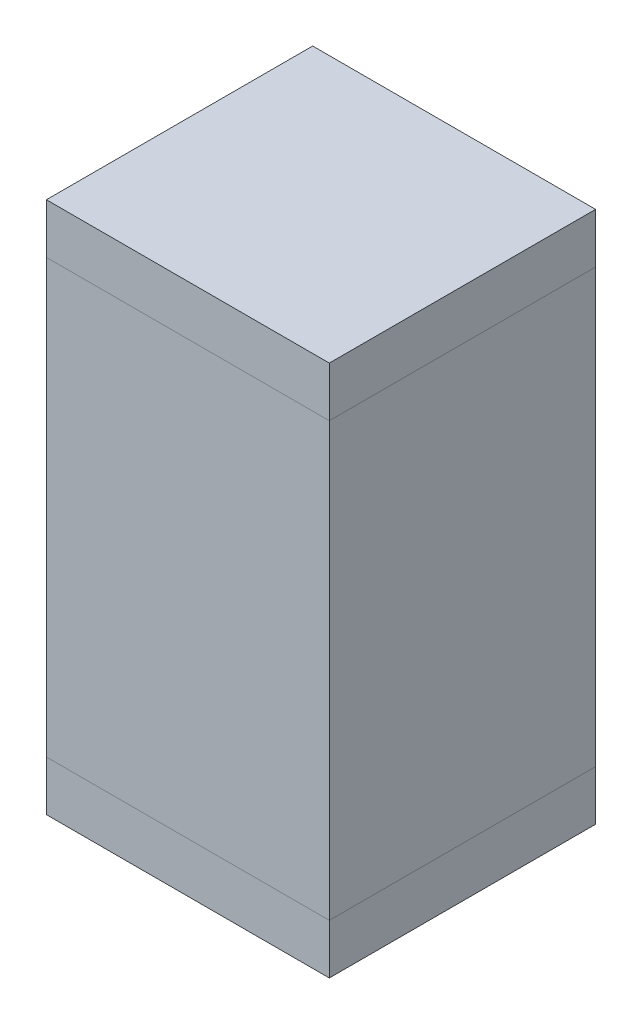
ISO-10303-21;
HEADER;
FILE_DESCRIPTION(('STEP AP214'),'2;1');
FILE_NAME('part.step','',(''),(''),'','','');
FILE_SCHEMA(('AUTOMOTIVE_DESIGN { 1 0 10303 214 1 1 1 1 }'));
ENDSEC;
DATA;
#1=APPLICATION_CONTEXT('core data for automotive mechanical design processes');
#2=APPLICATION_PROTOCOL_DEFINITION('international standard','automotive_design',2000,#1);
#3=PRODUCT_CONTEXT('',#1,'mechanical');
#4=PRODUCT('Part','Part','',(#3));
#5=PRODUCT_RELATED_PRODUCT_CATEGORY('part','',(#4));
#6=PRODUCT_DEFINITION_FORMATION('','',#4);
#7=PRODUCT_DEFINITION_CONTEXT('part definition',#1,'design');
#8=PRODUCT_DEFINITION('design','',#6,#7);
#9=PRODUCT_DEFINITION_SHAPE('','',#8);
#10=(LENGTH_UNIT() NAMED_UNIT(*) SI_UNIT(.MILLI.,.METRE.));
#11=(NAMED_UNIT(*) PLANE_ANGLE_UNIT() SI_UNIT($,.RADIAN.));
#12=(NAMED_UNIT(*) SI_UNIT($,.STERADIAN.) SOLID_ANGLE_UNIT());
#13=UNCERTAINTY_MEASURE_WITH_UNIT(LENGTH_MEASURE(1.E-05),#10,'distance_accuracy_value','');
#14=(GEOMETRIC_REPRESENTATION_CONTEXT(3) GLOBAL_UNCERTAINTY_ASSIGNED_CONTEXT((#13)) GLOBAL_UNIT_ASSIGNED_CONTEXT((#10,
#11,#12)) REPRESENTATION_CONTEXT('',''));
#15=CARTESIAN_POINT('',(0.,0.,0.));
#16=DIRECTION('',(0.,0.,1.));
#17=DIRECTION('',(1.,0.,0.));
#18=AXIS2_PLACEMENT_3D('',#15,#16,#17);
#19=CARTESIAN_POINT('',(0.,0.,0.));
#20=DIRECTION('',(0.,0.,1.));
#21=DIRECTION('',(1.,0.,0.));
#22=AXIS2_PLACEMENT_3D('',#19,#20,#21);
#23=PLANE('',#22);
#24=DIRECTION('',(1.,0.,0.));
#25=VECTOR('',#24,1.);
#26=CARTESIAN_POINT('',(-0.425,0.65,0.));
#27=LINE('',#26,#25);
#28=CARTESIAN_POINT('',(-0.425,0.65,0.));
#29=VERTEX_POINT('',#28);
#30=CARTESIAN_POINT('',(0.425,0.65,0.));
#31=VERTEX_POINT('',#30);
#32=EDGE_CURVE('P0_E26',#29,#31,#27,.T.);
#33=ORIENTED_EDGE('',*,*,#32,.T.);
#34=DIRECTION('',(0.,-1.,0.));
#35=VECTOR('',#34,1.);
#36=CARTESIAN_POINT('',(0.425,0.65,0.));
#37=LINE('',#36,#35);
#38=CARTESIAN_POINT('',(0.425,-0.65,0.));
#39=VERTEX_POINT('',#38);
#40=EDGE_CURVE('P0_E92',#31,#39,#37,.T.);
#41=ORIENTED_EDGE('',*,*,#40,.T.);
#42=DIRECTION('',(-1.,0.,0.));
#43=VECTOR('',#42,1.);
#44=CARTESIAN_POINT('',(0.425,-0.65,0.));
#45=LINE('',#44,#43);
#46=CARTESIAN_POINT('',(-0.425,-0.65,0.));
#47=VERTEX_POINT('',#46);
#48=EDGE_CURVE('P0_E85',#39,#47,#45,.T.);
#49=ORIENTED_EDGE('',*,*,#48,.T.);
#50=DIRECTION('',(0.,1.,0.));
#51=VECTOR('',#50,1.);
#52=CARTESIAN_POINT('',(-0.425,-0.65,0.));
#53=LINE('',#52,#51);
#54=EDGE_CURVE('P0_E70',#47,#29,#53,.T.);
#55=ORIENTED_EDGE('',*,*,#54,.T.);
#56=EDGE_LOOP('',(#33,#41,#49,#55));
#57=FACE_BOUND('',#56,.T.);
#58=ADVANCED_FACE('P0_F17',(#57),#23,.F.);
#59=CARTESIAN_POINT('',(0.,0.,0.8));
#60=DIRECTION('',(0.,0.,1.));
#61=DIRECTION('',(1.,0.,0.));
#62=AXIS2_PLACEMENT_3D('',#59,#60,#61);
#63=PLANE('',#62);
#64=DIRECTION('',(-1.,0.,0.));
#65=VECTOR('',#64,1.);
#66=CARTESIAN_POINT('',(-0.425,0.65,0.8));
#67=LINE('',#66,#65);
#68=CARTESIAN_POINT('',(0.425,0.65,0.8));
#69=VERTEX_POINT('',#68);
#70=CARTESIAN_POINT('',(-0.425,0.65,0.8));
#71=VERTEX_POINT('',#70);
#72=EDGE_CURVE('P0_E11',#69,#71,#67,.T.);
#73=ORIENTED_EDGE('',*,*,#72,.T.);
#74=DIRECTION('',(0.,-1.,0.));
#75=VECTOR('',#74,1.);
#76=CARTESIAN_POINT('',(-0.425,-0.65,0.8));
#77=LINE('',#76,#75);
#78=CARTESIAN_POINT('',(-0.425,-0.65,0.8));
#79=VERTEX_POINT('',#78);
#80=EDGE_CURVE('P0_E80',#71,#79,#77,.T.);
#81=ORIENTED_EDGE('',*,*,#80,.T.);
#82=DIRECTION('',(1.,0.,0.));
#83=VECTOR('',#82,1.);
#84=CARTESIAN_POINT('',(0.425,-0.65,0.8));
#85=LINE('',#84,#83);
#86=CARTESIAN_POINT('',(0.425,-0.65,0.8));
#87=VERTEX_POINT('',#86);
#88=EDGE_CURVE('P0_E87',#79,#87,#85,.T.);
#89=ORIENTED_EDGE('',*,*,#88,.T.);
#90=DIRECTION('',(0.,1.,0.));
#91=VECTOR('',#90,1.);
#92=CARTESIAN_POINT('',(0.425,0.65,0.8));
#93=LINE('',#92,#91);
#94=EDGE_CURVE('P0_E100',#87,#69,#93,.T.);
#95=ORIENTED_EDGE('',*,*,#94,.T.);
#96=EDGE_LOOP('',(#73,#81,#89,#95));
#97=FACE_BOUND('',#96,.T.);
#98=ADVANCED_FACE('P0_F19',(#97),#63,.T.);
#99=CARTESIAN_POINT('',(0.425,0.65,0.));
#100=DIRECTION('',(0.,1.,0.));
#101=DIRECTION('',(1.,0.,0.));
#102=AXIS2_PLACEMENT_3D('',#99,#100,#101);
#103=PLANE('',#102);
#104=ORIENTED_EDGE('',*,*,#32,.F.);
#105=DIRECTION('',(0.,0.,1.));
#106=VECTOR('',#105,1.);
#107=CARTESIAN_POINT('',(-0.425,0.65,0.));
#108=LINE('',#107,#106);
#109=EDGE_CURVE('P0_E76',#29,#71,#108,.T.);
#110=ORIENTED_EDGE('',*,*,#109,.T.);
#111=ORIENTED_EDGE('',*,*,#72,.F.);
#112=DIRECTION('',(0.,0.,1.));
#113=VECTOR('',#112,1.);
#114=CARTESIAN_POINT('',(0.425,0.65,0.));
#115=LINE('',#114,#113);
#116=EDGE_CURVE('P0_E113',#31,#69,#115,.T.);
#117=ORIENTED_EDGE('',*,*,#116,.F.);
#118=EDGE_LOOP('',(#104,#110,#111,#117));
#119=FACE_BOUND('',#118,.T.);
#120=ADVANCED_FACE('P0_F121',(#119),#103,.T.);
#121=CARTESIAN_POINT('',(-0.425,0.65,0.));
#122=DIRECTION('',(-1.,0.,0.));
#123=DIRECTION('',(0.,0.,1.));
#124=AXIS2_PLACEMENT_3D('',#121,#122,#123);
#125=PLANE('',#124);
#126=ORIENTED_EDGE('',*,*,#54,.F.);
#127=DIRECTION('',(0.,0.,1.));
#128=VECTOR('',#127,1.);
#129=CARTESIAN_POINT('',(-0.425,-0.65,0.));
#130=LINE('',#129,#128);
#131=EDGE_CURVE('P0_E74',#47,#79,#130,.T.);
#132=ORIENTED_EDGE('',*,*,#131,.T.);
#133=ORIENTED_EDGE('',*,*,#80,.F.);
#134=ORIENTED_EDGE('',*,*,#109,.F.);
#135=EDGE_LOOP('',(#126,#132,#133,#134));
#136=FACE_BOUND('',#135,.T.);
#137=ADVANCED_FACE('P0_F72',(#136),#125,.T.);
#138=CARTESIAN_POINT('',(-0.425,-0.65,0.));
#139=DIRECTION('',(0.,-1.,0.));
#140=DIRECTION('',(0.,0.,-1.));
#141=AXIS2_PLACEMENT_3D('',#138,#139,#140);
#142=PLANE('',#141);
#143=ORIENTED_EDGE('',*,*,#48,.F.);
#144=DIRECTION('',(0.,0.,1.));
#145=VECTOR('',#144,1.);
#146=CARTESIAN_POINT('',(0.425,-0.65,0.));
#147=LINE('',#146,#145);
#148=EDGE_CURVE('P0_E94',#39,#87,#147,.T.);
#149=ORIENTED_EDGE('',*,*,#148,.T.);
#150=ORIENTED_EDGE('',*,*,#88,.F.);
#151=ORIENTED_EDGE('',*,*,#131,.F.);
#152=EDGE_LOOP('',(#143,#149,#150,#151));
#153=FACE_BOUND('',#152,.T.);
#154=ADVANCED_FACE('P0_F83',(#153),#142,.T.);
#155=CARTESIAN_POINT('',(0.425,-0.65,0.));
#156=DIRECTION('',(1.,0.,0.));
#157=DIRECTION('',(0.,1.,0.));
#158=AXIS2_PLACEMENT_3D('',#155,#156,#157);
#159=PLANE('',#158);
#160=ORIENTED_EDGE('',*,*,#40,.F.);
#161=ORIENTED_EDGE('',*,*,#116,.T.);
#162=ORIENTED_EDGE('',*,*,#94,.F.);
#163=ORIENTED_EDGE('',*,*,#148,.F.);
#164=EDGE_LOOP('',(#160,#161,#162,#163));
#165=FACE_BOUND('',#164,.T.);
#166=ADVANCED_FACE('P0_F120',(#165),#159,.T.);
#167=CLOSED_SHELL('',(#58,#98,#120,#137,#154,#166));
#168=MANIFOLD_SOLID_BREP('P0_B1',#167);
#169=CARTESIAN_POINT('',(0.425,0.65,0.));
#170=DIRECTION('',(0.,1.,0.));
#171=DIRECTION('',(1.,0.,0.));
#172=AXIS2_PLACEMENT_3D('',#169,#170,#171);
#173=PLANE('',#172);
#174=DIRECTION('',(1.,0.,0.));
#175=VECTOR('',#174,1.);
#176=CARTESIAN_POINT('',(-0.425,0.65,0.));
#177=LINE('',#176,#175);
#178=CARTESIAN_POINT('',(-0.425,0.65,0.));
#179=VERTEX_POINT('',#178);
#180=CARTESIAN_POINT('',(0.425,0.65,0.));
#181=VERTEX_POINT('',#180);
#182=EDGE_CURVE('P1_E21',#179,#181,#177,.T.);
#183=ORIENTED_EDGE('',*,*,#182,.T.);
#184=DIRECTION('',(0.,0.,1.));
#185=VECTOR('',#184,1.);
#186=CARTESIAN_POINT('',(0.425,0.65,0.));
#187=LINE('',#186,#185);
#188=CARTESIAN_POINT('',(0.425,0.65,0.8));
#189=VERTEX_POINT('',#188);
#190=EDGE_CURVE('P1_E71',#181,#189,#187,.T.);
#191=ORIENTED_EDGE('',*,*,#190,.T.);
#192=DIRECTION('',(-1.,0.,0.));
#193=VECTOR('',#192,1.);
#194=CARTESIAN_POINT('',(-0.425,0.65,0.8));
#195=LINE('',#194,#193);
#196=CARTESIAN_POINT('',(-0.425,0.65,0.8));
#197=VERTEX_POINT('',#196);
#198=EDGE_CURVE('P1_E95',#189,#197,#195,.T.);
#199=ORIENTED_EDGE('',*,*,#198,.T.);
#200=DIRECTION('',(0.,0.,1.));
#201=VECTOR('',#200,1.);
#202=CARTESIAN_POINT('',(-0.425,0.65,0.));
#203=LINE('',#202,#201);
#204=EDGE_CURVE('P1_E72',#179,#197,#203,.T.);
#205=ORIENTED_EDGE('',*,*,#204,.F.);
#206=EDGE_LOOP('',(#183,#191,#199,#205));
#207=FACE_BOUND('',#206,.T.);
#208=ADVANCED_FACE('P1_F17',(#207),#173,.F.);
#209=CARTESIAN_POINT('',(0.425,0.8,0.));
#210=DIRECTION('',(0.,1.,0.));
#211=DIRECTION('',(1.,0.,0.));
#212=AXIS2_PLACEMENT_3D('',#209,#210,#211);
#213=PLANE('',#212);
#214=DIRECTION('',(-1.,0.,0.));
#215=VECTOR('',#214,1.);
#216=CARTESIAN_POINT('',(-0.425,0.8,0.));
#217=LINE('',#216,#215);
#218=CARTESIAN_POINT('',(0.425,0.8,0.));
#219=VERTEX_POINT('',#218);
#220=CARTESIAN_POINT('',(-0.425,0.8,0.));
#221=VERTEX_POINT('',#220);
#222=EDGE_CURVE('P1_E11',#219,#221,#217,.T.);
#223=ORIENTED_EDGE('',*,*,#222,.T.);
#224=DIRECTION('',(0.,0.,1.));
#225=VECTOR('',#224,1.);
#226=CARTESIAN_POINT('',(-0.425,0.8,0.));
#227=LINE('',#226,#225);
#228=CARTESIAN_POINT('',(-0.425,0.8,0.8));
#229=VERTEX_POINT('',#228);
#230=EDGE_CURVE('P1_E93',#221,#229,#227,.T.);
#231=ORIENTED_EDGE('',*,*,#230,.T.);
#232=DIRECTION('',(1.,0.,0.));
#233=VECTOR('',#232,1.);
#234=CARTESIAN_POINT('',(-0.425,0.8,0.8));
#235=LINE('',#234,#233);
#236=CARTESIAN_POINT('',(0.425,0.8,0.8));
#237=VERTEX_POINT('',#236);
#238=EDGE_CURVE('P1_E97',#229,#237,#235,.T.);
#239=ORIENTED_EDGE('',*,*,#238,.T.);
#240=DIRECTION('',(0.,0.,-1.));
#241=VECTOR('',#240,1.);
#242=CARTESIAN_POINT('',(0.425,0.8,0.));
#243=LINE('',#242,#241);
#244=EDGE_CURVE('P1_E81',#237,#219,#243,.T.);
#245=ORIENTED_EDGE('',*,*,#244,.T.);
#246=EDGE_LOOP('',(#223,#231,#239,#245));
#247=FACE_BOUND('',#246,.T.);
#248=ADVANCED_FACE('P1_F19',(#247),#213,.T.);
#249=CARTESIAN_POINT('',(0.425,0.65,0.));
#250=DIRECTION('',(0.,0.,-1.));
#251=DIRECTION('',(0.,-1.,0.));
#252=AXIS2_PLACEMENT_3D('',#249,#250,#251);
#253=PLANE('',#252);
#254=ORIENTED_EDGE('',*,*,#182,.F.);
#255=DIRECTION('',(0.,1.,0.));
#256=VECTOR('',#255,1.);
#257=CARTESIAN_POINT('',(-0.425,0.65,0.));
#258=LINE('',#257,#256);
#259=EDGE_CURVE('P1_E74',#179,#221,#258,.T.);
#260=ORIENTED_EDGE('',*,*,#259,.T.);
#261=ORIENTED_EDGE('',*,*,#222,.F.);
#262=DIRECTION('',(0.,1.,0.));
#263=VECTOR('',#262,1.);
#264=CARTESIAN_POINT('',(0.425,0.65,0.));
#265=LINE('',#264,#263);
#266=EDGE_CURVE('P1_E76',#181,#219,#265,.T.);
#267=ORIENTED_EDGE('',*,*,#266,.F.);
#268=EDGE_LOOP('',(#254,#260,#261,#267));
#269=FACE_BOUND('',#268,.T.);
#270=ADVANCED_FACE('P1_F77',(#269),#253,.T.);
#271=CARTESIAN_POINT('',(-0.425,0.65,0.));
#272=DIRECTION('',(-1.,0.,0.));
#273=DIRECTION('',(0.,0.,1.));
#274=AXIS2_PLACEMENT_3D('',#271,#272,#273);
#275=PLANE('',#274);
#276=ORIENTED_EDGE('',*,*,#204,.T.);
#277=DIRECTION('',(0.,1.,0.));
#278=VECTOR('',#277,1.);
#279=CARTESIAN_POINT('',(-0.425,0.65,0.8));
#280=LINE('',#279,#278);
#281=EDGE_CURVE('P1_E94',#197,#229,#280,.T.);
#282=ORIENTED_EDGE('',*,*,#281,.T.);
#283=ORIENTED_EDGE('',*,*,#230,.F.);
#284=ORIENTED_EDGE('',*,*,#259,.F.);
#285=EDGE_LOOP('',(#276,#282,#283,#284));
#286=FACE_BOUND('',#285,.T.);
#287=ADVANCED_FACE('P1_F114',(#286),#275,.T.);
#288=CARTESIAN_POINT('',(-0.425,0.65,0.8));
#289=DIRECTION('',(0.,0.,1.));
#290=DIRECTION('',(1.,0.,0.));
#291=AXIS2_PLACEMENT_3D('',#288,#289,#290);
#292=PLANE('',#291);
#293=ORIENTED_EDGE('',*,*,#198,.F.);
#294=DIRECTION('',(0.,1.,0.));
#295=VECTOR('',#294,1.);
#296=CARTESIAN_POINT('',(0.425,0.65,0.8));
#297=LINE('',#296,#295);
#298=EDGE_CURVE('P1_E86',#189,#237,#297,.T.);
#299=ORIENTED_EDGE('',*,*,#298,.T.);
#300=ORIENTED_EDGE('',*,*,#238,.F.);
#301=ORIENTED_EDGE('',*,*,#281,.F.);
#302=EDGE_LOOP('',(#293,#299,#300,#301));
#303=FACE_BOUND('',#302,.T.);
#304=ADVANCED_FACE('P1_F118',(#303),#292,.T.);
#305=CARTESIAN_POINT('',(0.425,0.65,0.8));
#306=DIRECTION('',(1.,0.,0.));
#307=DIRECTION('',(0.,1.,0.));
#308=AXIS2_PLACEMENT_3D('',#305,#306,#307);
#309=PLANE('',#308);
#310=ORIENTED_EDGE('',*,*,#190,.F.);
#311=ORIENTED_EDGE('',*,*,#266,.T.);
#312=ORIENTED_EDGE('',*,*,#244,.F.);
#313=ORIENTED_EDGE('',*,*,#298,.F.);
#314=EDGE_LOOP('',(#310,#311,#312,#313));
#315=FACE_BOUND('',#314,.T.);
#316=ADVANCED_FACE('P1_F84',(#315),#309,.T.);
#317=CLOSED_SHELL('',(#208,#248,#270,#287,#304,#316));
#318=MANIFOLD_SOLID_BREP('P1_B1',#317);
#319=CARTESIAN_POINT('',(-0.425,-0.65,0.));
#320=DIRECTION('',(0.,-1.,0.));
#321=DIRECTION('',(0.,0.,-1.));
#322=AXIS2_PLACEMENT_3D('',#319,#320,#321);
#323=PLANE('',#322);
#324=DIRECTION('',(-1.,0.,0.));
#325=VECTOR('',#324,1.);
#326=CARTESIAN_POINT('',(0.425,-0.65,0.));
#327=LINE('',#326,#325);
#328=CARTESIAN_POINT('',(0.425,-0.65,0.));
#329=VERTEX_POINT('',#328);
#330=CARTESIAN_POINT('',(-0.425,-0.65,0.));
#331=VERTEX_POINT('',#330);
#332=EDGE_CURVE('P2_E27',#329,#331,#327,.T.);
#333=ORIENTED_EDGE('',*,*,#332,.T.);
#334=DIRECTION('',(0.,0.,1.));
#335=VECTOR('',#334,1.);
#336=CARTESIAN_POINT('',(-0.425,-0.65,0.));
#337=LINE('',#336,#335);
#338=CARTESIAN_POINT('',(-0.425,-0.65,0.8));
#339=VERTEX_POINT('',#338);
#340=EDGE_CURVE('P2_E88',#331,#339,#337,.T.);
#341=ORIENTED_EDGE('',*,*,#340,.T.);
#342=DIRECTION('',(1.,0.,0.));
#343=VECTOR('',#342,1.);
#344=CARTESIAN_POINT('',(0.425,-0.65,0.8));
#345=LINE('',#344,#343);
#346=CARTESIAN_POINT('',(0.425,-0.65,0.8));
#347=VERTEX_POINT('',#346);
#348=EDGE_CURVE('P2_E81',#339,#347,#345,.T.);
#349=ORIENTED_EDGE('',*,*,#348,.T.);
#350=DIRECTION('',(0.,0.,1.));
#351=VECTOR('',#350,1.);
#352=CARTESIAN_POINT('',(0.425,-0.65,0.));
#353=LINE('',#352,#351);
#354=EDGE_CURVE('P2_E66',#329,#347,#353,.T.);
#355=ORIENTED_EDGE('',*,*,#354,.F.);
#356=EDGE_LOOP('',(#333,#341,#349,#355));
#357=FACE_BOUND('',#356,.T.);
#358=ADVANCED_FACE('P2_F17',(#357),#323,.F.);
#359=CARTESIAN_POINT('',(-0.425,-0.8,0.));
#360=DIRECTION('',(0.,-1.,0.));
#361=DIRECTION('',(0.,0.,-1.));
#362=AXIS2_PLACEMENT_3D('',#359,#360,#361);
#363=PLANE('',#362);
#364=DIRECTION('',(1.,0.,0.));
#365=VECTOR('',#364,1.);
#366=CARTESIAN_POINT('',(0.425,-0.8,0.));
#367=LINE('',#366,#365);
#368=CARTESIAN_POINT('',(-0.425,-0.8,0.));
#369=VERTEX_POINT('',#368);
#370=CARTESIAN_POINT('',(0.425,-0.8,0.));
#371=VERTEX_POINT('',#370);
#372=EDGE_CURVE('P2_E11',#369,#371,#367,.T.);
#373=ORIENTED_EDGE('',*,*,#372,.T.);
#374=DIRECTION('',(0.,0.,1.));
#375=VECTOR('',#374,1.);
#376=CARTESIAN_POINT('',(0.425,-0.8,0.));
#377=LINE('',#376,#375);
#378=CARTESIAN_POINT('',(0.425,-0.8,0.8));
#379=VERTEX_POINT('',#378);
#380=EDGE_CURVE('P2_E76',#371,#379,#377,.T.);
#381=ORIENTED_EDGE('',*,*,#380,.T.);
#382=DIRECTION('',(-1.,0.,0.));
#383=VECTOR('',#382,1.);
#384=CARTESIAN_POINT('',(0.425,-0.8,0.8));
#385=LINE('',#384,#383);
#386=CARTESIAN_POINT('',(-0.425,-0.8,0.8));
#387=VERTEX_POINT('',#386);
#388=EDGE_CURVE('P2_E83',#379,#387,#385,.T.);
#389=ORIENTED_EDGE('',*,*,#388,.T.);
#390=DIRECTION('',(0.,0.,-1.));
#391=VECTOR('',#390,1.);
#392=CARTESIAN_POINT('',(-0.425,-0.8,0.));
#393=LINE('',#392,#391);
#394=EDGE_CURVE('P2_E98',#387,#369,#393,.T.);
#395=ORIENTED_EDGE('',*,*,#394,.T.);
#396=EDGE_LOOP('',(#373,#381,#389,#395));
#397=FACE_BOUND('',#396,.T.);
#398=ADVANCED_FACE('P2_F121',(#397),#363,.T.);
#399=CARTESIAN_POINT('',(-0.425,-0.65,0.));
#400=DIRECTION('',(0.,0.,-1.));
#401=DIRECTION('',(0.,-1.,0.));
#402=AXIS2_PLACEMENT_3D('',#399,#400,#401);
#403=PLANE('',#402);
#404=ORIENTED_EDGE('',*,*,#332,.F.);
#405=DIRECTION('',(0.,-1.,0.));
#406=VECTOR('',#405,1.);
#407=CARTESIAN_POINT('',(0.425,-0.65,0.));
#408=LINE('',#407,#406);
#409=EDGE_CURVE('P2_E72',#329,#371,#408,.T.);
#410=ORIENTED_EDGE('',*,*,#409,.T.);
#411=ORIENTED_EDGE('',*,*,#372,.F.);
#412=DIRECTION('',(0.,-1.,0.));
#413=VECTOR('',#412,1.);
#414=CARTESIAN_POINT('',(-0.425,-0.65,0.));
#415=LINE('',#414,#413);
#416=EDGE_CURVE('P2_E103',#331,#369,#415,.T.);
#417=ORIENTED_EDGE('',*,*,#416,.F.);
#418=EDGE_LOOP('',(#404,#410,#411,#417));
#419=FACE_BOUND('',#418,.T.);
#420=ADVANCED_FACE('P2_F19',(#419),#403,.T.);
#421=CARTESIAN_POINT('',(0.425,-0.65,0.));
#422=DIRECTION('',(1.,0.,0.));
#423=DIRECTION('',(0.,1.,0.));
#424=AXIS2_PLACEMENT_3D('',#421,#422,#423);
#425=PLANE('',#424);
#426=ORIENTED_EDGE('',*,*,#354,.T.);
#427=DIRECTION('',(0.,-1.,0.));
#428=VECTOR('',#427,1.);
#429=CARTESIAN_POINT('',(0.425,-0.65,0.8));
#430=LINE('',#429,#428);
#431=EDGE_CURVE('P2_E70',#347,#379,#430,.T.);
#432=ORIENTED_EDGE('',*,*,#431,.T.);
#433=ORIENTED_EDGE('',*,*,#380,.F.);
#434=ORIENTED_EDGE('',*,*,#409,.F.);
#435=EDGE_LOOP('',(#426,#432,#433,#434));
#436=FACE_BOUND('',#435,.T.);
#437=ADVANCED_FACE('P2_F68',(#436),#425,.T.);
#438=CARTESIAN_POINT('',(0.425,-0.65,0.8));
#439=DIRECTION('',(0.,0.,1.));
#440=DIRECTION('',(1.,0.,0.));
#441=AXIS2_PLACEMENT_3D('',#438,#439,#440);
#442=PLANE('',#441);
#443=ORIENTED_EDGE('',*,*,#348,.F.);
#444=DIRECTION('',(0.,-1.,0.));
#445=VECTOR('',#444,1.);
#446=CARTESIAN_POINT('',(-0.425,-0.65,0.8));
#447=LINE('',#446,#445);
#448=EDGE_CURVE('P2_E90',#339,#387,#447,.T.);
#449=ORIENTED_EDGE('',*,*,#448,.T.);
#450=ORIENTED_EDGE('',*,*,#388,.F.);
#451=ORIENTED_EDGE('',*,*,#431,.F.);
#452=EDGE_LOOP('',(#443,#449,#450,#451));
#453=FACE_BOUND('',#452,.T.);
#454=ADVANCED_FACE('P2_F79',(#453),#442,.T.);
#455=CARTESIAN_POINT('',(-0.425,-0.65,0.8));
#456=DIRECTION('',(-1.,0.,0.));
#457=DIRECTION('',(0.,0.,1.));
#458=AXIS2_PLACEMENT_3D('',#455,#456,#457);
#459=PLANE('',#458);
#460=ORIENTED_EDGE('',*,*,#340,.F.);
#461=ORIENTED_EDGE('',*,*,#416,.T.);
#462=ORIENTED_EDGE('',*,*,#394,.F.);
#463=ORIENTED_EDGE('',*,*,#448,.F.);
#464=EDGE_LOOP('',(#460,#461,#462,#463));
#465=FACE_BOUND('',#464,.T.);
#466=ADVANCED_FACE('P2_F115',(#465),#459,.T.);
#467=CLOSED_SHELL('',(#358,#398,#420,#437,#454,#466));
#468=MANIFOLD_SOLID_BREP('P2_B1',#467);
#469=ADVANCED_BREP_SHAPE_REPRESENTATION('',(#18,#168,#318,#468),#14);
#470=SHAPE_DEFINITION_REPRESENTATION(#9,#469);
ENDSEC;
END-ISO-10303-21;
